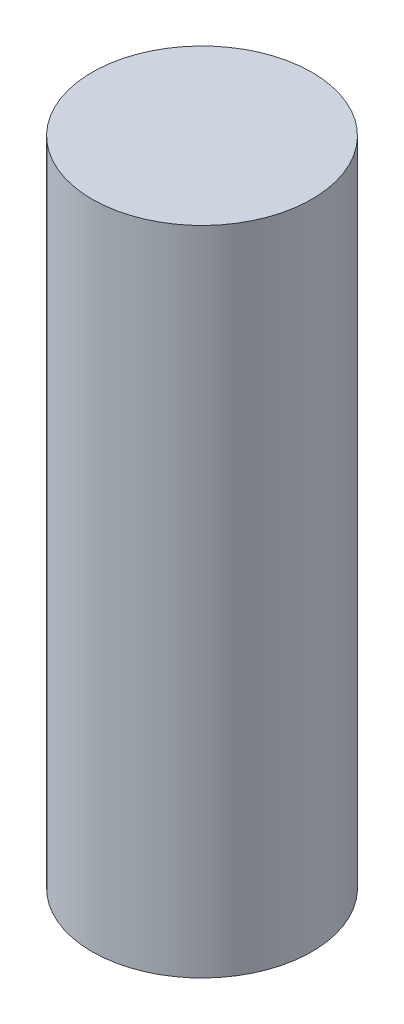
ISO-10303-21;
HEADER;
FILE_DESCRIPTION(('STEP AP214'),'2;1');
FILE_NAME('part.step','',(''),(''),'','','');
FILE_SCHEMA(('AUTOMOTIVE_DESIGN { 1 0 10303 214 1 1 1 1 }'));
ENDSEC;
DATA;
#1=APPLICATION_CONTEXT('core data for automotive mechanical design processes');
#2=APPLICATION_PROTOCOL_DEFINITION('international standard','automotive_design',2000,#1);
#3=PRODUCT_CONTEXT('',#1,'mechanical');
#4=PRODUCT('Part','Part','',(#3));
#5=PRODUCT_RELATED_PRODUCT_CATEGORY('part','',(#4));
#6=PRODUCT_DEFINITION_FORMATION('','',#4);
#7=PRODUCT_DEFINITION_CONTEXT('part definition',#1,'design');
#8=PRODUCT_DEFINITION('design','',#6,#7);
#9=PRODUCT_DEFINITION_SHAPE('','',#8);
#10=(LENGTH_UNIT() NAMED_UNIT(*) SI_UNIT(.MILLI.,.METRE.));
#11=(NAMED_UNIT(*) PLANE_ANGLE_UNIT() SI_UNIT($,.RADIAN.));
#12=(NAMED_UNIT(*) SI_UNIT($,.STERADIAN.) SOLID_ANGLE_UNIT());
#13=UNCERTAINTY_MEASURE_WITH_UNIT(LENGTH_MEASURE(1.E-05),#10,'distance_accuracy_value','');
#14=(GEOMETRIC_REPRESENTATION_CONTEXT(3) GLOBAL_UNCERTAINTY_ASSIGNED_CONTEXT((#13)) GLOBAL_UNIT_ASSIGNED_CONTEXT((#10,
#11,#12)) REPRESENTATION_CONTEXT('',''));
#15=CARTESIAN_POINT('',(0.,0.,0.));
#16=DIRECTION('',(0.,0.,1.));
#17=DIRECTION('',(1.,0.,0.));
#18=AXIS2_PLACEMENT_3D('',#15,#16,#17);
#19=CARTESIAN_POINT('',(0.,20.75,0.));
#20=DIRECTION('',(0.,-1.,0.));
#21=DIRECTION('',(0.,0.,-1.));
#22=AXIS2_PLACEMENT_3D('',#19,#20,#21);
#23=CYLINDRICAL_SURFACE('',#22,7.);
#24=CARTESIAN_POINT('',(0.,20.75,0.));
#25=DIRECTION('',(0.,1.,0.));
#26=DIRECTION('',(0.,0.,1.));
#27=AXIS2_PLACEMENT_3D('',#24,#25,#26);
#28=CIRCLE('',#27,7.);
#29=CARTESIAN_POINT('',(0.,20.75,7.));
#30=VERTEX_POINT('',#29);
#31=EDGE_CURVE('E10',#30,#30,#28,.T.);
#32=ORIENTED_EDGE('',*,*,#31,.F.);
#33=EDGE_LOOP('',(#32));
#34=FACE_BOUND('',#33,.T.);
#35=CARTESIAN_POINT('',(0.,-20.75,0.));
#36=DIRECTION('',(0.,1.,0.));
#37=DIRECTION('',(0.,0.,1.));
#38=AXIS2_PLACEMENT_3D('',#35,#36,#37);
#39=CIRCLE('',#38,7.);
#40=CARTESIAN_POINT('',(0.,-20.75,7.));
#41=VERTEX_POINT('',#40);
#42=EDGE_CURVE('E50',#41,#41,#39,.T.);
#43=ORIENTED_EDGE('',*,*,#42,.T.);
#44=EDGE_LOOP('',(#43));
#45=FACE_BOUND('',#44,.T.);
#46=ADVANCED_FACE('F47',(#34,#45),#23,.T.);
#47=CARTESIAN_POINT('',(0.,20.75,0.));
#48=DIRECTION('',(0.,1.,0.));
#49=DIRECTION('',(0.,0.,1.));
#50=AXIS2_PLACEMENT_3D('',#47,#48,#49);
#51=PLANE('',#50);
#52=ORIENTED_EDGE('',*,*,#31,.T.);
#53=EDGE_LOOP('',(#52));
#54=FACE_BOUND('',#53,.T.);
#55=ADVANCED_FACE('F64',(#54),#51,.T.);
#56=CARTESIAN_POINT('',(0.,-20.75,0.));
#57=DIRECTION('',(0.,1.,0.));
#58=DIRECTION('',(0.,0.,1.));
#59=AXIS2_PLACEMENT_3D('',#56,#57,#58);
#60=PLANE('',#59);
#61=ORIENTED_EDGE('',*,*,#42,.F.);
#62=EDGE_LOOP('',(#61));
#63=FACE_BOUND('',#62,.T.);
#64=ADVANCED_FACE('F62',(#63),#60,.F.);
#65=CLOSED_SHELL('',(#46,#55,#64));
#66=MANIFOLD_SOLID_BREP('B2',#65);
#67=ADVANCED_BREP_SHAPE_REPRESENTATION('',(#18,#66),#14);
#68=SHAPE_DEFINITION_REPRESENTATION(#9,#67);
ENDSEC;
END-ISO-10303-21;
